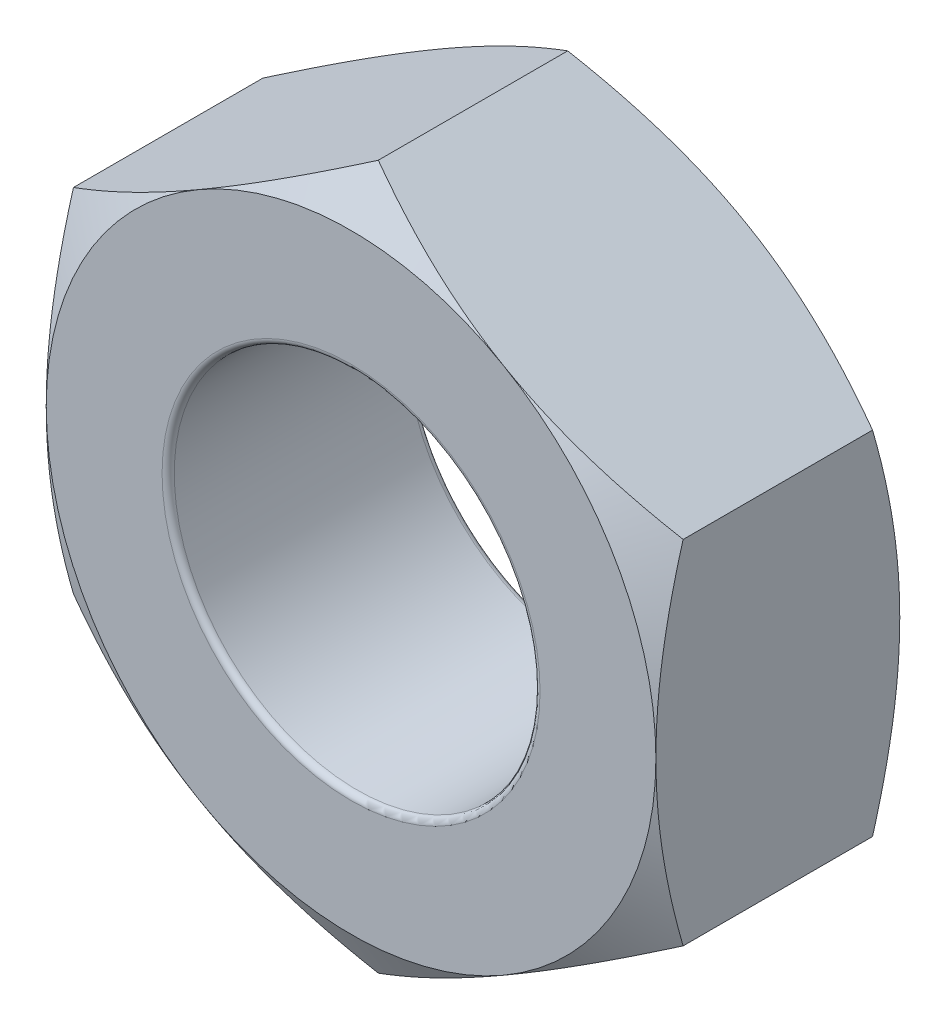
ISO-10303-21;
HEADER;
FILE_DESCRIPTION(('STEP AP214'),'2;1');
FILE_NAME('part.step','',(''),(''),'','','');
FILE_SCHEMA(('AUTOMOTIVE_DESIGN { 1 0 10303 214 1 1 1 1 }'));
ENDSEC;
DATA;
#1=APPLICATION_CONTEXT('core data for automotive mechanical design processes');
#2=APPLICATION_PROTOCOL_DEFINITION('international standard','automotive_design',2000,#1);
#3=PRODUCT_CONTEXT('',#1,'mechanical');
#4=PRODUCT('Part','Part','',(#3));
#5=PRODUCT_RELATED_PRODUCT_CATEGORY('part','',(#4));
#6=PRODUCT_DEFINITION_FORMATION('','',#4);
#7=PRODUCT_DEFINITION_CONTEXT('part definition',#1,'design');
#8=PRODUCT_DEFINITION('design','',#6,#7);
#9=PRODUCT_DEFINITION_SHAPE('','',#8);
#10=(LENGTH_UNIT() NAMED_UNIT(*) SI_UNIT(.MILLI.,.METRE.));
#11=(NAMED_UNIT(*) PLANE_ANGLE_UNIT() SI_UNIT($,.RADIAN.));
#12=(NAMED_UNIT(*) SI_UNIT($,.STERADIAN.) SOLID_ANGLE_UNIT());
#13=UNCERTAINTY_MEASURE_WITH_UNIT(LENGTH_MEASURE(1.E-05),#10,'distance_accuracy_value','');
#14=(GEOMETRIC_REPRESENTATION_CONTEXT(3) GLOBAL_UNCERTAINTY_ASSIGNED_CONTEXT((#13)) GLOBAL_UNIT_ASSIGNED_CONTEXT((#10,
#11,#12)) REPRESENTATION_CONTEXT('',''));
#15=CARTESIAN_POINT('',(0.,0.,0.));
#16=DIRECTION('',(0.,0.,1.));
#17=DIRECTION('',(1.,0.,0.));
#18=AXIS2_PLACEMENT_3D('',#15,#16,#17);
#19=CARTESIAN_POINT('',(-2.5,-1.44337567297407,2.));
#20=DIRECTION('',(0.5,0.866025403784439,0.));
#21=DIRECTION('',(-0.866025403784439,0.5,0.));
#22=AXIS2_PLACEMENT_3D('',#19,#20,#21);
#23=PLANE('',#22);
#24=CARTESIAN_POINT('',(0.000199999999999842,-2.88686681600197,0.223357664359108));
#25=CARTESIAN_POINT('',(-0.109663234734871,-2.82343724785375,0.186721620107626));
#26=CARTESIAN_POINT('',(-0.220474799896526,-2.75946016087834,0.153402218965056));
#27=CARTESIAN_POINT('',(-0.44401683346605,-2.63039810762178,0.0952422855578576));
#28=CARTESIAN_POINT('',(-0.556751274528388,-2.5653108477275,0.0704223291477381));
#29=CARTESIAN_POINT('',(-0.780822993875269,-2.43594298024479,0.0317856514410519));
#30=CARTESIAN_POINT('',(-0.892125791767377,-2.37168227992023,0.0177117961856389));
#31=CARTESIAN_POINT('',(-1.11525522746833,-2.24285844015415,0.000909152352750234));
#32=CARTESIAN_POINT('',(-1.22708105401423,-2.17829576909553,-0.00183354879637336));
#33=CARTESIAN_POINT('',(-1.43604197555152,-2.05765212479586,0.00386576000805364));
#34=CARTESIAN_POINT('',(-1.53320831755773,-2.0015531110824,0.0109083943818618));
#35=CARTESIAN_POINT('',(-1.726907949711,-1.88972057631678,0.0332314191249426));
#36=CARTESIAN_POINT('',(-1.82344056965973,-1.8339874422038,0.0485194384402671));
#37=CARTESIAN_POINT('',(-2.01753972174048,-1.7219242445005,0.0867390938444203));
#38=CARTESIAN_POINT('',(-2.11508168178214,-1.66560836761316,0.109832776125517));
#39=CARTESIAN_POINT('',(-2.30871060807609,-1.55381665489446,0.162246656577913));
#40=CARTESIAN_POINT('',(-2.40480005588618,-1.49833938633502,0.191554535624548));
#41=CARTESIAN_POINT('',(-2.5002,-1.44326020292023,0.223357664359108));
#42=B_SPLINE_CURVE_WITH_KNOTS('',3,(#24,#25,#26,#27,#28,#29,#30,#31,#32,#33,#34,#35,#36,#37,#38,
#39,#40,#41),.UNSPECIFIED.,.F.,.F.,(4,2,2,2,2,2,2,2,4),(0.,0.396285827362227,0.793524330152051,
1.18093086852114,1.56786160134475,1.90479741793733,2.24204551660463,2.58677531536756,
2.93082800105256),.UNSPECIFIED.);
#43=CARTESIAN_POINT('',(0.,-2.88675134594813,0.223290993692601));
#44=VERTEX_POINT('',#43);
#45=CARTESIAN_POINT('',(-1.25,-2.1650635094611,0.));
#46=VERTEX_POINT('',#45);
#47=EDGE_CURVE('E374',#44,#46,#42,.T.);
#48=ORIENTED_EDGE('',*,*,#47,.F.);
#49=DIRECTION('',(0.,0.,-1.));
#50=VECTOR('',#49,1.);
#51=CARTESIAN_POINT('',(0.,-2.88675134594813,2.));
#52=LINE('',#51,#50);
#53=CARTESIAN_POINT('',(0.,-2.88675134594813,1.7767090063074));
#54=VERTEX_POINT('',#53);
#55=EDGE_CURVE('E318',#54,#44,#52,.T.);
#56=ORIENTED_EDGE('',*,*,#55,.F.);
#57=CARTESIAN_POINT('',(-2.5002,-1.44326020292023,1.77664233564089));
#58=CARTESIAN_POINT('',(-2.39033676526513,-1.50668977106845,1.81327837989237));
#59=CARTESIAN_POINT('',(-2.27952520010348,-1.57066685804385,1.84659778103494));
#60=CARTESIAN_POINT('',(-2.05598316653395,-1.69972891130041,1.90475771444214));
#61=CARTESIAN_POINT('',(-1.94324872547161,-1.7648161711947,1.92957767085226));
#62=CARTESIAN_POINT('',(-1.71917700612473,-1.8941840386774,1.96821434855895));
#63=CARTESIAN_POINT('',(-1.60787420823262,-1.95844473900197,1.98228820381436));
#64=CARTESIAN_POINT('',(-1.38474477253167,-2.08726857876804,1.99909084764725));
#65=CARTESIAN_POINT('',(-1.27291894598577,-2.15183124982667,2.00183354879637));
#66=CARTESIAN_POINT('',(-1.06395802444848,-2.27247489412634,1.99613423999195));
#67=CARTESIAN_POINT('',(-0.966791682442269,-2.32857390783979,1.98909160561814));
#68=CARTESIAN_POINT('',(-0.773092050288998,-2.44040644260542,1.96676858087506));
#69=CARTESIAN_POINT('',(-0.676559430340268,-2.4961395767184,1.95148056155973));
#70=CARTESIAN_POINT('',(-0.482460278259524,-2.60820277442169,1.91326090615558));
#71=CARTESIAN_POINT('',(-0.38491831821786,-2.66451865130903,1.89016722387448));
#72=CARTESIAN_POINT('',(-0.191289391923915,-2.77631036402774,1.83775334342209));
#73=CARTESIAN_POINT('',(-0.095199944113824,-2.83178763258718,1.80844546437545));
#74=CARTESIAN_POINT('',(0.000199999999999875,-2.88686681600197,1.77664233564089));
#75=B_SPLINE_CURVE_WITH_KNOTS('',3,(#57,#58,#59,#60,#61,#62,#63,#64,#65,#66,#67,#68,#69,#70,#71,
#72,#73,#74),.UNSPECIFIED.,.F.,.F.,(4,2,2,2,2,2,2,2,4),(0.,0.396285827362227,0.793524330152051,
1.18093086852114,1.56786160134475,1.90479741793733,2.24204551660463,2.58677531536756,
2.93082800105256),.UNSPECIFIED.);
#76=CARTESIAN_POINT('',(-1.25,-2.1650635094611,2.));
#77=VERTEX_POINT('',#76);
#78=EDGE_CURVE('E257',#77,#54,#75,.T.);
#79=ORIENTED_EDGE('',*,*,#78,.F.);
#80=CARTESIAN_POINT('',(-2.5,-1.44337567297407,1.7767090063074));
#81=VERTEX_POINT('',#80);
#82=EDGE_CURVE('E331',#81,#77,#75,.T.);
#83=ORIENTED_EDGE('',*,*,#82,.F.);
#84=DIRECTION('',(0.,0.,-1.));
#85=VECTOR('',#84,1.);
#86=CARTESIAN_POINT('',(-2.5,-1.44337567297407,2.));
#87=LINE('',#86,#85);
#88=CARTESIAN_POINT('',(-2.5,-1.44337567297407,0.223290993692602));
#89=VERTEX_POINT('',#88);
#90=EDGE_CURVE('E329',#81,#89,#87,.T.);
#91=ORIENTED_EDGE('',*,*,#90,.T.);
#92=EDGE_CURVE('E211',#46,#89,#42,.T.);
#93=ORIENTED_EDGE('',*,*,#92,.F.);
#94=EDGE_LOOP('',(#48,#56,#79,#83,#91,#93));
#95=FACE_BOUND('',#94,.T.);
#96=ADVANCED_FACE('F37',(#95),#23,.F.);
#97=CARTESIAN_POINT('',(0.,-2.88675134594813,2.));
#98=DIRECTION('',(-0.5,0.866025403784439,0.));
#99=DIRECTION('',(-0.866025403784439,-0.5,0.));
#100=AXIS2_PLACEMENT_3D('',#97,#98,#99);
#101=PLANE('',#100);
#102=CARTESIAN_POINT('',(2.5002,-1.44326020292023,0.223357664359109));
#103=CARTESIAN_POINT('',(2.39033676526513,-1.50668977106845,0.186721620107626));
#104=CARTESIAN_POINT('',(2.27952520010348,-1.57066685804385,0.153402218965056));
#105=CARTESIAN_POINT('',(2.05598316653395,-1.69972891130041,0.0952422855578581));
#106=CARTESIAN_POINT('',(1.94324872547161,-1.7648161711947,0.0704223291477387));
#107=CARTESIAN_POINT('',(1.71917700612473,-1.8941840386774,0.0317856514410525));
#108=CARTESIAN_POINT('',(1.60787420823262,-1.95844473900197,0.0177117961856395));
#109=CARTESIAN_POINT('',(1.38474477253167,-2.08726857876804,0.000909152352750747));
#110=CARTESIAN_POINT('',(1.27291894598577,-2.15183124982667,-0.00183354879637297));
#111=CARTESIAN_POINT('',(1.06395802444848,-2.27247489412634,0.00386576000805378));
#112=CARTESIAN_POINT('',(0.96679168244227,-2.32857390783979,0.0109083943818619));
#113=CARTESIAN_POINT('',(0.773092050288998,-2.44040644260542,0.0332314191249426));
#114=CARTESIAN_POINT('',(0.676559430340268,-2.4961395767184,0.0485194384402671));
#115=CARTESIAN_POINT('',(0.482460278259524,-2.60820277442169,0.0867390938444202));
#116=CARTESIAN_POINT('',(0.38491831821786,-2.66451865130903,0.109832776125517));
#117=CARTESIAN_POINT('',(0.191289391923915,-2.77631036402774,0.162246656577913));
#118=CARTESIAN_POINT('',(0.0951999441138241,-2.83178763258718,0.191554535624548));
#119=CARTESIAN_POINT('',(-0.000199999999999849,-2.88686681600197,0.223357664359108));
#120=B_SPLINE_CURVE_WITH_KNOTS('',3,(#102,#103,#104,#105,#106,#107,#108,#109,#110,#111,#112,
#113,#114,#115,#116,#117,#118,#119),.UNSPECIFIED.,.F.,.F.,(4,2,2,2,2,2,2,2,4),(0.,
0.396285827362227,0.793524330152051,1.18093086852114,1.56786160134475,1.90479741793733,
2.24204551660463,2.58677531536756,2.93082800105256),.UNSPECIFIED.);
#121=CARTESIAN_POINT('',(2.5,-1.44337567297406,0.223290993692602));
#122=VERTEX_POINT('',#121);
#123=CARTESIAN_POINT('',(1.25,-2.1650635094611,0.));
#124=VERTEX_POINT('',#123);
#125=EDGE_CURVE('E147',#122,#124,#120,.T.);
#126=ORIENTED_EDGE('',*,*,#125,.F.);
#127=DIRECTION('',(0.,0.,-1.));
#128=VECTOR('',#127,1.);
#129=CARTESIAN_POINT('',(2.5,-1.44337567297406,2.));
#130=LINE('',#129,#128);
#131=CARTESIAN_POINT('',(2.5,-1.44337567297406,1.7767090063074));
#132=VERTEX_POINT('',#131);
#133=EDGE_CURVE('E162',#132,#122,#130,.T.);
#134=ORIENTED_EDGE('',*,*,#133,.F.);
#135=CARTESIAN_POINT('',(-0.000200000000000107,-2.88686681600197,1.77664233564089));
#136=CARTESIAN_POINT('',(0.109663234734871,-2.82343724785375,1.81327837989237));
#137=CARTESIAN_POINT('',(0.220474799896526,-2.75946016087834,1.84659778103494));
#138=CARTESIAN_POINT('',(0.44401683346605,-2.63039810762178,1.90475771444214));
#139=CARTESIAN_POINT('',(0.556751274528388,-2.5653108477275,1.92957767085226));
#140=CARTESIAN_POINT('',(0.780822993875269,-2.43594298024479,1.96821434855895));
#141=CARTESIAN_POINT('',(0.892125791767377,-2.37168227992023,1.98228820381436));
#142=CARTESIAN_POINT('',(1.11525522746833,-2.24285844015415,1.99909084764725));
#143=CARTESIAN_POINT('',(1.22708105401423,-2.17829576909553,2.00183354879637));
#144=CARTESIAN_POINT('',(1.43604197555152,-2.05765212479586,1.99613423999195));
#145=CARTESIAN_POINT('',(1.53320831755773,-2.0015531110824,1.98909160561814));
#146=CARTESIAN_POINT('',(1.726907949711,-1.88972057631678,1.96676858087506));
#147=CARTESIAN_POINT('',(1.82344056965973,-1.8339874422038,1.95148056155973));
#148=CARTESIAN_POINT('',(2.01753972174048,-1.7219242445005,1.91326090615558));
#149=CARTESIAN_POINT('',(2.11508168178214,-1.66560836761316,1.89016722387448));
#150=CARTESIAN_POINT('',(2.30871060807609,-1.55381665489446,1.83775334342209));
#151=CARTESIAN_POINT('',(2.40480005588618,-1.49833938633502,1.80844546437545));
#152=CARTESIAN_POINT('',(2.5002,-1.44326020292023,1.77664233564089));
#153=B_SPLINE_CURVE_WITH_KNOTS('',3,(#135,#136,#137,#138,#139,#140,#141,#142,#143,#144,#145,
#146,#147,#148,#149,#150,#151,#152),.UNSPECIFIED.,.F.,.F.,(4,2,2,2,2,2,2,2,4),(0.,
0.396285827362227,0.793524330152051,1.18093086852114,1.56786160134475,1.90479741793733,
2.24204551660463,2.58677531536756,2.93082800105257),.UNSPECIFIED.);
#154=CARTESIAN_POINT('',(1.25,-2.1650635094611,2.));
#155=VERTEX_POINT('',#154);
#156=EDGE_CURVE('E250',#155,#132,#153,.T.);
#157=ORIENTED_EDGE('',*,*,#156,.F.);
#158=EDGE_CURVE('E256',#54,#155,#153,.T.);
#159=ORIENTED_EDGE('',*,*,#158,.F.);
#160=ORIENTED_EDGE('',*,*,#55,.T.);
#161=EDGE_CURVE('E172',#124,#44,#120,.T.);
#162=ORIENTED_EDGE('',*,*,#161,.F.);
#163=EDGE_LOOP('',(#126,#134,#157,#159,#160,#162));
#164=FACE_BOUND('',#163,.T.);
#165=ADVANCED_FACE('F263',(#164),#101,.F.);
#166=CARTESIAN_POINT('',(2.5,-1.44337567297406,2.));
#167=DIRECTION('',(-1.,0.,0.));
#168=DIRECTION('',(0.,-1.,0.));
#169=AXIS2_PLACEMENT_3D('',#166,#167,#168);
#170=PLANE('',#169);
#171=CARTESIAN_POINT('',(2.5,4.93486171933444,1.75051746805577));
#172=CARTESIAN_POINT('',(2.5,4.8199403481942,1.69133726261722));
#173=CARTESIAN_POINT('',(2.5,4.70485212642124,1.63247825676005));
#174=CARTESIAN_POINT('',(2.5,4.47426567976795,1.51556406119456));
#175=CARTESIAN_POINT('',(2.5,4.3587674473533,1.45750888635444));
#176=CARTESIAN_POINT('',(2.5,4.12710089531368,1.34227244134488));
#177=CARTESIAN_POINT('',(2.5,4.01093179192169,1.28509274407798));
#178=CARTESIAN_POINT('',(2.5,3.77801122649482,1.17192590701674));
#179=CARTESIAN_POINT('',(2.5,3.66125975622101,1.11593878415348));
#180=CARTESIAN_POINT('',(2.5,3.42088300849687,1.00253157682963));
#181=CARTESIAN_POINT('',(2.5,3.2972198482005,0.94519156160896));
#182=CARTESIAN_POINT('',(2.5,3.04894788037271,0.832598686179217));
#183=CARTESIAN_POINT('',(2.5,2.92433909834247,0.777345769924557));
#184=CARTESIAN_POINT('',(2.5,2.67404231382757,0.669564709168185));
#185=CARTESIAN_POINT('',(2.5,2.54835509963059,0.617034744165752));
#186=CARTESIAN_POINT('',(2.5,2.29553518807958,0.51547060395183));
#187=CARTESIAN_POINT('',(2.5,2.16840216282304,0.466437240853759));
#188=CARTESIAN_POINT('',(2.5,1.89196933857389,0.365519045589161));
#189=CARTESIAN_POINT('',(2.5,1.74237414052598,0.314430928565566));
#190=CARTESIAN_POINT('',(2.5,1.4405551511059,0.220856049236355));
#191=CARTESIAN_POINT('',(2.5,1.28833272889575,0.178364945289854));
#192=CARTESIAN_POINT('',(2.5,0.983942199808397,0.10575228958798));
#193=CARTESIAN_POINT('',(2.5,0.831829132495783,0.0754089672818123));
#194=CARTESIAN_POINT('',(2.5,0.602071425625843,0.0406516796303225));
#195=CARTESIAN_POINT('',(2.5,0.525228449493817,0.0308592992319918));
#196=CARTESIAN_POINT('',(2.5,0.371150643177173,0.015163665679469));
#197=CARTESIAN_POINT('',(2.5,0.293915874561849,0.00925981943211573));
#198=CARTESIAN_POINT('',(2.5,0.13817730801555,0.00149945618362761));
#199=CARTESIAN_POINT('',(2.5,0.0596706558577326,-0.000300329680071862));
#200=CARTESIAN_POINT('',(2.5,-0.0973237037747566,0.000382182470509603));
#201=CARTESIAN_POINT('',(2.5,-0.175811411250472,0.00286448024899066));
#202=CARTESIAN_POINT('',(2.5,-0.33255646239666,0.0120180751018753));
#203=CARTESIAN_POINT('',(2.5,-0.410813755021101,0.0186902391546229));
#204=CARTESIAN_POINT('',(2.5,-0.566895759516456,0.0359818737124392));
#205=CARTESIAN_POINT('',(2.5,-0.644720398746937,0.0466019878865543));
#206=CARTESIAN_POINT('',(2.5,-0.880425277323258,0.0843776540425927));
#207=CARTESIAN_POINT('',(2.5,-1.0374021276822,0.11724429044599));
#208=CARTESIAN_POINT('',(2.5,-1.34841101742391,0.194551132550417));
#209=CARTESIAN_POINT('',(2.5,-1.50244211517955,0.23899497472662));
#210=CARTESIAN_POINT('',(2.5,-1.80198948227857,0.334467726657708));
#211=CARTESIAN_POINT('',(2.5,-1.94760725909514,0.385183371784437));
#212=CARTESIAN_POINT('',(2.5,-2.23674360042291,0.492317846941426));
#213=CARTESIAN_POINT('',(2.5,-2.38026164031034,0.548738075330582));
#214=CARTESIAN_POINT('',(2.5,-2.66572180096044,0.665809108984892));
#215=CARTESIAN_POINT('',(2.5,-2.80766213451906,0.726464237701915));
#216=CARTESIAN_POINT('',(2.5,-3.0901760741915,0.850881769521233));
#217=CARTESIAN_POINT('',(2.5,-3.23074960496675,0.914644342755144));
#218=CARTESIAN_POINT('',(2.5,-3.50283338488746,1.04081855009125));
#219=CARTESIAN_POINT('',(2.5,-3.63440403331771,1.10310046173394));
#220=CARTESIAN_POINT('',(2.5,-3.89676431270017,1.2292955254876));
#221=CARTESIAN_POINT('',(2.5,-4.02755391777178,1.29320873128699));
#222=CARTESIAN_POINT('',(2.5,-4.28806433847912,1.42210820195559));
#223=CARTESIAN_POINT('',(2.5,-4.41778725733017,1.48709022600769));
#224=CARTESIAN_POINT('',(2.5,-4.67669676330922,1.61808743263322));
#225=CARTESIAN_POINT('',(2.5,-4.8058833956229,1.68410252583257));
#226=CARTESIAN_POINT('',(2.5,-4.93486171933444,1.75051746805577));
#227=B_SPLINE_CURVE_WITH_KNOTS('',3,(#171,#172,#173,#174,#175,#176,#177,#178,#179,#180,#181,
#182,#183,#184,#185,#186,#187,#188,#189,#190,#191,#192,#193,#194,#195,#196,#197,#198,#199,#200,
#201,#202,#203,#204,#205,#206,#207,#208,#209,#210,#211,#212,#213,#214,#215,#216,#217,#218,#219,
#220,#221,#222,#223,#224,#225,#226),.UNSPECIFIED.,.F.,.F.,(4,2,2,2,2,2,2,2,2,2,2,2,2,2,2,2,2,2,
2,2,2,2,2,2,2,2,2,4),(0.,0.387793831894924,0.775594827128252,1.16402581850153,1.5524623207934,
1.96137758264064,2.37028185592793,2.77890912291194,3.1876309897647,3.66167496284643,
4.13547893462243,4.60018855861607,4.83249783003166,5.06477166059454,5.30023727903514,
5.53570288450944,5.77121722921933,6.00676998875775,6.48725754661897,6.96789621109928,
7.43032586595214,7.89286915182353,8.35589175957823,8.81893974621792,9.25562834373433,
9.69233133192936,10.1275921173417,10.5628154528867),.UNSPECIFIED.);
#228=CARTESIAN_POINT('',(2.5,1.44337567297407,0.223290993692602));
#229=VERTEX_POINT('',#228);
#230=CARTESIAN_POINT('',(2.5,0.,0.));
#231=VERTEX_POINT('',#230);
#232=EDGE_CURVE('E126',#229,#231,#227,.T.);
#233=ORIENTED_EDGE('',*,*,#232,.F.);
#234=DIRECTION('',(0.,0.,-1.));
#235=VECTOR('',#234,1.);
#236=CARTESIAN_POINT('',(2.5,1.44337567297407,2.));
#237=LINE('',#236,#235);
#238=CARTESIAN_POINT('',(2.5,1.44337567297407,1.7767090063074));
#239=VERTEX_POINT('',#238);
#240=EDGE_CURVE('E322',#239,#229,#237,.T.);
#241=ORIENTED_EDGE('',*,*,#240,.F.);
#242=CARTESIAN_POINT('',(2.5,-4.93486171933444,0.249482531944228));
#243=CARTESIAN_POINT('',(2.5,-4.8199403481942,0.308662737382781));
#244=CARTESIAN_POINT('',(2.5,-4.70485212642124,0.36752174323995));
#245=CARTESIAN_POINT('',(2.5,-4.47426567976795,0.48443593880544));
#246=CARTESIAN_POINT('',(2.5,-4.3587674473533,0.542491113645563));
#247=CARTESIAN_POINT('',(2.5,-4.12710089531368,0.657727558655123));
#248=CARTESIAN_POINT('',(2.5,-4.01093179192169,0.714907255922022));
#249=CARTESIAN_POINT('',(2.5,-3.77801122649482,0.828074092983264));
#250=CARTESIAN_POINT('',(2.5,-3.66125975622101,0.884061215846521));
#251=CARTESIAN_POINT('',(2.5,-3.42088300849687,0.997468423170368));
#252=CARTESIAN_POINT('',(2.5,-3.2972198482005,1.05480843839104));
#253=CARTESIAN_POINT('',(2.5,-3.04894788037271,1.16740131382078));
#254=CARTESIAN_POINT('',(2.5,-2.92433909834247,1.22265423007544));
#255=CARTESIAN_POINT('',(2.5,-2.67404231382757,1.33043529083182));
#256=CARTESIAN_POINT('',(2.5,-2.54835509963059,1.38296525583425));
#257=CARTESIAN_POINT('',(2.5,-2.29553518807957,1.48452939604817));
#258=CARTESIAN_POINT('',(2.5,-2.16840216282304,1.53356275914624));
#259=CARTESIAN_POINT('',(2.5,-1.89196933857388,1.63448095441084));
#260=CARTESIAN_POINT('',(2.5,-1.74237414052597,1.68556907143443));
#261=CARTESIAN_POINT('',(2.5,-1.4405551511059,1.77914395076365));
#262=CARTESIAN_POINT('',(2.5,-1.28833272889575,1.82163505471015));
#263=CARTESIAN_POINT('',(2.5,-0.983942199808395,1.89424771041202));
#264=CARTESIAN_POINT('',(2.5,-0.831829132495782,1.92459103271819));
#265=CARTESIAN_POINT('',(2.5,-0.602071425625842,1.95934832036968));
#266=CARTESIAN_POINT('',(2.5,-0.525228449493816,1.96914070076801));
#267=CARTESIAN_POINT('',(2.5,-0.371150643177171,1.98483633432053));
#268=CARTESIAN_POINT('',(2.5,-0.293915874561847,1.99074018056788));
#269=CARTESIAN_POINT('',(2.5,-0.138177308015548,1.99850054381637));
#270=CARTESIAN_POINT('',(2.5,-0.0596706558577308,2.00030032968007));
#271=CARTESIAN_POINT('',(2.5,0.0973237037747584,1.99961781752949));
#272=CARTESIAN_POINT('',(2.5,0.175811411250474,1.99713551975101));
#273=CARTESIAN_POINT('',(2.5,0.332556462396662,1.98798192489812));
#274=CARTESIAN_POINT('',(2.5,0.410813755021103,1.98130976084538));
#275=CARTESIAN_POINT('',(2.5,0.566895759516458,1.96401812628756));
#276=CARTESIAN_POINT('',(2.5,0.644720398746939,1.95339801211345));
#277=CARTESIAN_POINT('',(2.5,0.88042527732326,1.91562234595741));
#278=CARTESIAN_POINT('',(2.5,1.0374021276822,1.88275570955401));
#279=CARTESIAN_POINT('',(2.5,1.34841101742391,1.80544886744958));
#280=CARTESIAN_POINT('',(2.5,1.50244211517955,1.76100502527338));
#281=CARTESIAN_POINT('',(2.5,1.80198948227857,1.66553227334229));
#282=CARTESIAN_POINT('',(2.5,1.94760725909515,1.61481662821556));
#283=CARTESIAN_POINT('',(2.5,2.23674360042291,1.50768215305857));
#284=CARTESIAN_POINT('',(2.5,2.38026164031034,1.45126192466942));
#285=CARTESIAN_POINT('',(2.5,2.66572180096044,1.33419089101511));
#286=CARTESIAN_POINT('',(2.5,2.80766213451906,1.27353576229808));
#287=CARTESIAN_POINT('',(2.5,3.0901760741915,1.14911823047877));
#288=CARTESIAN_POINT('',(2.5,3.23074960496675,1.08535565724486));
#289=CARTESIAN_POINT('',(2.5,3.50283338488747,0.959181449908747));
#290=CARTESIAN_POINT('',(2.5,3.63440403331771,0.896899538266062));
#291=CARTESIAN_POINT('',(2.5,3.89676431270018,0.770704474512404));
#292=CARTESIAN_POINT('',(2.5,4.02755391777179,0.706791268713009));
#293=CARTESIAN_POINT('',(2.5,4.28806433847913,0.577891798044409));
#294=CARTESIAN_POINT('',(2.5,4.41778725733018,0.512909773992308));
#295=CARTESIAN_POINT('',(2.5,4.67669676330922,0.381912567366776));
#296=CARTESIAN_POINT('',(2.5,4.8058833956229,0.315897474167429));
#297=CARTESIAN_POINT('',(2.5,4.93486171933444,0.249482531944229));
#298=B_SPLINE_CURVE_WITH_KNOTS('',3,(#242,#243,#244,#245,#246,#247,#248,#249,#250,#251,#252,
#253,#254,#255,#256,#257,#258,#259,#260,#261,#262,#263,#264,#265,#266,#267,#268,#269,#270,#271,
#272,#273,#274,#275,#276,#277,#278,#279,#280,#281,#282,#283,#284,#285,#286,#287,#288,#289,#290,
#291,#292,#293,#294,#295,#296,#297),.UNSPECIFIED.,.F.,.F.,(4,2,2,2,2,2,2,2,2,2,2,2,2,2,2,2,2,2,
2,2,2,2,2,2,2,2,2,4),(0.,0.387793831894923,0.775594827128251,1.16402581850153,1.5524623207934,
1.96137758264064,2.37028185592793,2.77890912291195,3.1876309897647,3.66167496284643,
4.13547893462243,4.60018855861608,4.83249783003166,5.06477166059454,5.30023727903514,
5.53570288450944,5.77121722921933,6.00676998875775,6.48725754661897,6.96789621109928,
7.43032586595214,7.89286915182353,8.35589175957823,8.81893974621792,9.25562834373433,
9.69233133192937,10.1275921173417,10.5628154528867),.UNSPECIFIED.);
#299=CARTESIAN_POINT('',(2.5,0.,2.));
#300=VERTEX_POINT('',#299);
#301=EDGE_CURVE('E243',#300,#239,#298,.T.);
#302=ORIENTED_EDGE('',*,*,#301,.F.);
#303=EDGE_CURVE('E249',#132,#300,#298,.T.);
#304=ORIENTED_EDGE('',*,*,#303,.F.);
#305=ORIENTED_EDGE('',*,*,#133,.T.);
#306=EDGE_CURVE('E139',#231,#122,#227,.T.);
#307=ORIENTED_EDGE('',*,*,#306,.F.);
#308=EDGE_LOOP('',(#233,#241,#302,#304,#305,#307));
#309=FACE_BOUND('',#308,.T.);
#310=ADVANCED_FACE('F159',(#309),#170,.F.);
#311=CARTESIAN_POINT('',(2.5,1.44337567297407,2.));
#312=DIRECTION('',(-0.5,-0.866025403784439,0.));
#313=DIRECTION('',(0.866025403784439,-0.5,0.));
#314=AXIS2_PLACEMENT_3D('',#311,#312,#313);
#315=PLANE('',#314);
#316=CARTESIAN_POINT('',(-0.000200000000001077,2.88686681600197,0.223357664359108));
#317=CARTESIAN_POINT('',(0.10966323473487,2.82343724785375,0.186721620107626));
#318=CARTESIAN_POINT('',(0.220474799896525,2.75946016087834,0.153402218965056));
#319=CARTESIAN_POINT('',(0.444016833466049,2.63039810762178,0.0952422855578579));
#320=CARTESIAN_POINT('',(0.556751274528387,2.5653108477275,0.0704223291477386));
#321=CARTESIAN_POINT('',(0.780822993875268,2.43594298024479,0.0317856514410523));
#322=CARTESIAN_POINT('',(0.892125791767376,2.37168227992023,0.0177117961856391));
#323=CARTESIAN_POINT('',(1.11525522746833,2.24285844015415,0.000909152352750306));
#324=CARTESIAN_POINT('',(1.22708105401423,2.17829576909553,-0.00183354879637321));
#325=CARTESIAN_POINT('',(1.43604197555152,2.05765212479586,0.00386576000805375));
#326=CARTESIAN_POINT('',(1.53320831755773,2.0015531110824,0.0109083943818619));
#327=CARTESIAN_POINT('',(1.726907949711,1.88972057631678,0.0332314191249426));
#328=CARTESIAN_POINT('',(1.82344056965973,1.8339874422038,0.0485194384402671));
#329=CARTESIAN_POINT('',(2.01753972174048,1.7219242445005,0.0867390938444204));
#330=CARTESIAN_POINT('',(2.11508168178214,1.66560836761316,0.109832776125517));
#331=CARTESIAN_POINT('',(2.30871060807609,1.55381665489446,0.162246656577913));
#332=CARTESIAN_POINT('',(2.40480005588618,1.49833938633502,0.191554535624549));
#333=CARTESIAN_POINT('',(2.5002,1.44326020292023,0.223357664359108));
#334=B_SPLINE_CURVE_WITH_KNOTS('',3,(#316,#317,#318,#319,#320,#321,#322,#323,#324,#325,#326,
#327,#328,#329,#330,#331,#332,#333),.UNSPECIFIED.,.F.,.F.,(4,2,2,2,2,2,2,2,4),(0.,
0.396285827362227,0.793524330152051,1.18093086852114,1.56786160134475,1.90479741793733,
2.24204551660463,2.58677531536756,2.93082800105257),.UNSPECIFIED.);
#335=CARTESIAN_POINT('',(0.,2.88675134594813,0.223290993692601));
#336=VERTEX_POINT('',#335);
#337=CARTESIAN_POINT('',(1.25,2.1650635094611,0.));
#338=VERTEX_POINT('',#337);
#339=EDGE_CURVE('E52',#336,#338,#334,.T.);
#340=ORIENTED_EDGE('',*,*,#339,.F.);
#341=DIRECTION('',(0.,0.,-1.));
#342=VECTOR('',#341,1.);
#343=CARTESIAN_POINT('',(0.,2.88675134594813,2.));
#344=LINE('',#343,#342);
#345=CARTESIAN_POINT('',(0.,2.88675134594813,1.7767090063074));
#346=VERTEX_POINT('',#345);
#347=EDGE_CURVE('E324',#346,#336,#344,.T.);
#348=ORIENTED_EDGE('',*,*,#347,.F.);
#349=CARTESIAN_POINT('',(2.5002,1.44326020292023,1.77664233564089));
#350=CARTESIAN_POINT('',(2.39033676526513,1.50668977106845,1.81327837989237));
#351=CARTESIAN_POINT('',(2.27952520010348,1.57066685804385,1.84659778103494));
#352=CARTESIAN_POINT('',(2.05598316653395,1.69972891130041,1.90475771444214));
#353=CARTESIAN_POINT('',(1.94324872547161,1.7648161711947,1.92957767085226));
#354=CARTESIAN_POINT('',(1.71917700612473,1.8941840386774,1.96821434855895));
#355=CARTESIAN_POINT('',(1.60787420823262,1.95844473900197,1.98228820381436));
#356=CARTESIAN_POINT('',(1.38474477253167,2.08726857876804,1.99909084764725));
#357=CARTESIAN_POINT('',(1.27291894598577,2.15183124982667,2.00183354879637));
#358=CARTESIAN_POINT('',(1.06395802444848,2.27247489412634,1.99613423999195));
#359=CARTESIAN_POINT('',(0.966791682442269,2.32857390783979,1.98909160561814));
#360=CARTESIAN_POINT('',(0.773092050288997,2.44040644260542,1.96676858087506));
#361=CARTESIAN_POINT('',(0.676559430340267,2.4961395767184,1.95148056155973));
#362=CARTESIAN_POINT('',(0.482460278259523,2.60820277442169,1.91326090615558));
#363=CARTESIAN_POINT('',(0.384918318217859,2.66451865130903,1.89016722387448));
#364=CARTESIAN_POINT('',(0.191289391923914,2.77631036402774,1.83775334342209));
#365=CARTESIAN_POINT('',(0.0951999441138231,2.83178763258718,1.80844546437545));
#366=CARTESIAN_POINT('',(-0.000200000000001067,2.88686681600197,1.77664233564089));
#367=B_SPLINE_CURVE_WITH_KNOTS('',3,(#349,#350,#351,#352,#353,#354,#355,#356,#357,#358,#359,
#360,#361,#362,#363,#364,#365,#366),.UNSPECIFIED.,.F.,.F.,(4,2,2,2,2,2,2,2,4),(0.,
0.396285827362227,0.793524330152051,1.18093086852114,1.56786160134475,1.90479741793733,
2.24204551660463,2.58677531536756,2.93082800105257),.UNSPECIFIED.);
#368=CARTESIAN_POINT('',(1.25,2.1650635094611,2.));
#369=VERTEX_POINT('',#368);
#370=EDGE_CURVE('E230',#369,#346,#367,.T.);
#371=ORIENTED_EDGE('',*,*,#370,.F.);
#372=EDGE_CURVE('E236',#239,#369,#367,.T.);
#373=ORIENTED_EDGE('',*,*,#372,.F.);
#374=ORIENTED_EDGE('',*,*,#240,.T.);
#375=EDGE_CURVE('E133',#338,#229,#334,.T.);
#376=ORIENTED_EDGE('',*,*,#375,.F.);
#377=EDGE_LOOP('',(#340,#348,#371,#373,#374,#376));
#378=FACE_BOUND('',#377,.T.);
#379=ADVANCED_FACE('F222',(#378),#315,.F.);
#380=CARTESIAN_POINT('',(0.,2.88675134594813,2.));
#381=DIRECTION('',(0.5,-0.866025403784439,0.));
#382=DIRECTION('',(0.866025403784439,0.5,0.));
#383=AXIS2_PLACEMENT_3D('',#380,#381,#382);
#384=PLANE('',#383);
#385=CARTESIAN_POINT('',(-2.5002,1.44326020292023,0.223357664359109));
#386=CARTESIAN_POINT('',(-2.39033676526513,1.50668977106845,0.186721620107626));
#387=CARTESIAN_POINT('',(-2.27952520010348,1.57066685804385,0.153402218965056));
#388=CARTESIAN_POINT('',(-2.05598316653395,1.69972891130041,0.0952422855578583));
#389=CARTESIAN_POINT('',(-1.94324872547161,1.7648161711947,0.0704223291477389));
#390=CARTESIAN_POINT('',(-1.71917700612473,1.8941840386774,0.0317856514410526));
#391=CARTESIAN_POINT('',(-1.60787420823262,1.95844473900197,0.0177117961856395));
#392=CARTESIAN_POINT('',(-1.38474477253167,2.08726857876805,0.000909152352750713));
#393=CARTESIAN_POINT('',(-1.27291894598577,2.15183124982667,-0.00183354879637293));
#394=CARTESIAN_POINT('',(-1.06395802444848,2.27247489412634,0.00386576000805397));
#395=CARTESIAN_POINT('',(-0.96679168244227,2.32857390783979,0.0109083943818621));
#396=CARTESIAN_POINT('',(-0.773092050288999,2.44040644260542,0.0332314191249428));
#397=CARTESIAN_POINT('',(-0.676559430340269,2.4961395767184,0.0485194384402673));
#398=CARTESIAN_POINT('',(-0.482460278259525,2.60820277442169,0.0867390938444204));
#399=CARTESIAN_POINT('',(-0.384918318217861,2.66451865130903,0.109832776125517));
#400=CARTESIAN_POINT('',(-0.191289391923916,2.77631036402774,0.162246656577913));
#401=CARTESIAN_POINT('',(-0.0951999441138251,2.83178763258718,0.191554535624548));
#402=CARTESIAN_POINT('',(0.000199999999999186,2.88686681600197,0.223357664359108));
#403=B_SPLINE_CURVE_WITH_KNOTS('',3,(#385,#386,#387,#388,#389,#390,#391,#392,#393,#394,#395,
#396,#397,#398,#399,#400,#401,#402),.UNSPECIFIED.,.F.,.F.,(4,2,2,2,2,2,2,2,4),(0.,
0.396285827362227,0.793524330152051,1.18093086852114,1.56786160134475,1.90479741793733,
2.24204551660463,2.58677531536756,2.93082800105256),.UNSPECIFIED.);
#404=CARTESIAN_POINT('',(-2.5,1.44337567297407,0.223290993692596));
#405=VERTEX_POINT('',#404);
#406=CARTESIAN_POINT('',(-1.25,2.1650635094611,0.));
#407=VERTEX_POINT('',#406);
#408=EDGE_CURVE('E60',#405,#407,#403,.T.);
#409=ORIENTED_EDGE('',*,*,#408,.F.);
#410=DIRECTION('',(0.,0.,-1.));
#411=VECTOR('',#410,1.);
#412=CARTESIAN_POINT('',(-2.5,1.44337567297407,2.));
#413=LINE('',#412,#411);
#414=CARTESIAN_POINT('',(-2.5,1.44337567297407,1.7767090063074));
#415=VERTEX_POINT('',#414);
#416=EDGE_CURVE('E327',#415,#405,#413,.T.);
#417=ORIENTED_EDGE('',*,*,#416,.F.);
#418=CARTESIAN_POINT('',(0.000199999999998983,2.88686681600197,1.77664233564089));
#419=CARTESIAN_POINT('',(-0.109663234734872,2.82343724785375,1.81327837989237));
#420=CARTESIAN_POINT('',(-0.220474799896527,2.75946016087834,1.84659778103494));
#421=CARTESIAN_POINT('',(-0.444016833466051,2.63039810762178,1.90475771444214));
#422=CARTESIAN_POINT('',(-0.556751274528389,2.5653108477275,1.92957767085226));
#423=CARTESIAN_POINT('',(-0.78082299387527,2.43594298024479,1.96821434855895));
#424=CARTESIAN_POINT('',(-0.892125791767378,2.37168227992023,1.98228820381436));
#425=CARTESIAN_POINT('',(-1.11525522746833,2.24285844015415,1.99909084764725));
#426=CARTESIAN_POINT('',(-1.22708105401423,2.17829576909553,2.00183354879637));
#427=CARTESIAN_POINT('',(-1.43604197555152,2.05765212479586,1.99613423999195));
#428=CARTESIAN_POINT('',(-1.53320831755773,2.0015531110824,1.98909160561814));
#429=CARTESIAN_POINT('',(-1.726907949711,1.88972057631678,1.96676858087506));
#430=CARTESIAN_POINT('',(-1.82344056965973,1.8339874422038,1.95148056155973));
#431=CARTESIAN_POINT('',(-2.01753972174048,1.7219242445005,1.91326090615558));
#432=CARTESIAN_POINT('',(-2.11508168178214,1.66560836761316,1.89016722387448));
#433=CARTESIAN_POINT('',(-2.30871060807609,1.55381665489446,1.83775334342209));
#434=CARTESIAN_POINT('',(-2.40480005588618,1.49833938633502,1.80844546437545));
#435=CARTESIAN_POINT('',(-2.5002,1.44326020292023,1.77664233564089));
#436=B_SPLINE_CURVE_WITH_KNOTS('',3,(#418,#419,#420,#421,#422,#423,#424,#425,#426,#427,#428,
#429,#430,#431,#432,#433,#434,#435),.UNSPECIFIED.,.F.,.F.,(4,2,2,2,2,2,2,2,4),(0.,
0.396285827362227,0.793524330152051,1.18093086852114,1.56786160134475,1.90479741793733,
2.24204551660463,2.58677531536756,2.93082800105256),.UNSPECIFIED.);
#437=CARTESIAN_POINT('',(-1.25,2.1650635094611,2.));
#438=VERTEX_POINT('',#437);
#439=EDGE_CURVE('E238',#438,#415,#436,.T.);
#440=ORIENTED_EDGE('',*,*,#439,.F.);
#441=EDGE_CURVE('E237',#346,#438,#436,.T.);
#442=ORIENTED_EDGE('',*,*,#441,.F.);
#443=ORIENTED_EDGE('',*,*,#347,.T.);
#444=EDGE_CURVE('E221',#407,#336,#403,.T.);
#445=ORIENTED_EDGE('',*,*,#444,.F.);
#446=EDGE_LOOP('',(#409,#417,#440,#442,#443,#445));
#447=FACE_BOUND('',#446,.T.);
#448=ADVANCED_FACE('F225',(#447),#384,.F.);
#449=CARTESIAN_POINT('',(-2.5,1.44337567297407,2.));
#450=DIRECTION('',(1.,0.,0.));
#451=DIRECTION('',(0.,1.,0.));
#452=AXIS2_PLACEMENT_3D('',#449,#450,#451);
#453=PLANE('',#452);
#454=CARTESIAN_POINT('',(-2.5,-4.93486171933444,1.75051746805577));
#455=CARTESIAN_POINT('',(-2.5,-4.8199403481942,1.69133726261722));
#456=CARTESIAN_POINT('',(-2.5,-4.70485212642124,1.63247825676005));
#457=CARTESIAN_POINT('',(-2.5,-4.47426567976795,1.51556406119456));
#458=CARTESIAN_POINT('',(-2.5,-4.3587674473533,1.45750888635444));
#459=CARTESIAN_POINT('',(-2.5,-4.12710089531368,1.34227244134488));
#460=CARTESIAN_POINT('',(-2.5,-4.01093179192169,1.28509274407798));
#461=CARTESIAN_POINT('',(-2.5,-3.77801122649482,1.17192590701674));
#462=CARTESIAN_POINT('',(-2.5,-3.66125975622101,1.11593878415348));
#463=CARTESIAN_POINT('',(-2.5,-3.42088300849687,1.00253157682963));
#464=CARTESIAN_POINT('',(-2.5,-3.2972198482005,0.94519156160896));
#465=CARTESIAN_POINT('',(-2.5,-3.04894788037271,0.832598686179217));
#466=CARTESIAN_POINT('',(-2.5,-2.92433909834247,0.777345769924557));
#467=CARTESIAN_POINT('',(-2.5,-2.67404231382757,0.669564709168184));
#468=CARTESIAN_POINT('',(-2.5,-2.54835509963059,0.617034744165752));
#469=CARTESIAN_POINT('',(-2.5,-2.29553518807958,0.515470603951829));
#470=CARTESIAN_POINT('',(-2.5,-2.16840216282304,0.466437240853759));
#471=CARTESIAN_POINT('',(-2.5,-1.89196933857389,0.365519045589161));
#472=CARTESIAN_POINT('',(-2.5,-1.74237414052598,0.314430928565566));
#473=CARTESIAN_POINT('',(-2.5,-1.4405551511059,0.220856049236355));
#474=CARTESIAN_POINT('',(-2.5,-1.28833272889575,0.178364945289854));
#475=CARTESIAN_POINT('',(-2.5,-0.983942199808397,0.10575228958798));
#476=CARTESIAN_POINT('',(-2.5,-0.831829132495783,0.0754089672818123));
#477=CARTESIAN_POINT('',(-2.5,-0.602071425625843,0.0406516796303225));
#478=CARTESIAN_POINT('',(-2.5,-0.525228449493817,0.0308592992319918));
#479=CARTESIAN_POINT('',(-2.5,-0.371150643177173,0.015163665679469));
#480=CARTESIAN_POINT('',(-2.5,-0.293915874561848,0.00925981943211573));
#481=CARTESIAN_POINT('',(-2.5,-0.13817730801555,0.0014994561836276));
#482=CARTESIAN_POINT('',(-2.5,-0.0596706558577325,-0.000300329680071867));
#483=CARTESIAN_POINT('',(-2.5,0.0973237037747567,0.000382182470509608));
#484=CARTESIAN_POINT('',(-2.5,0.175811411250472,0.00286448024899067));
#485=CARTESIAN_POINT('',(-2.5,0.33255646239666,0.0120180751018753));
#486=CARTESIAN_POINT('',(-2.5,0.410813755021101,0.0186902391546229));
#487=CARTESIAN_POINT('',(-2.5,0.566895759516457,0.0359818737124393));
#488=CARTESIAN_POINT('',(-2.5,0.644720398746937,0.0466019878865545));
#489=CARTESIAN_POINT('',(-2.5,0.880425277323259,0.0843776540425931));
#490=CARTESIAN_POINT('',(-2.5,1.0374021276822,0.11724429044599));
#491=CARTESIAN_POINT('',(-2.5,1.34841101742391,0.194551132550417));
#492=CARTESIAN_POINT('',(-2.5,1.50244211517955,0.23899497472662));
#493=CARTESIAN_POINT('',(-2.5,1.80198948227857,0.334467726657708));
#494=CARTESIAN_POINT('',(-2.5,1.94760725909514,0.385183371784437));
#495=CARTESIAN_POINT('',(-2.5,2.23674360042291,0.492317846941426));
#496=CARTESIAN_POINT('',(-2.5,2.38026164031034,0.548738075330582));
#497=CARTESIAN_POINT('',(-2.5,2.66572180096044,0.665809108984892));
#498=CARTESIAN_POINT('',(-2.5,2.80766213451906,0.726464237701915));
#499=CARTESIAN_POINT('',(-2.5,3.0901760741915,0.850881769521233));
#500=CARTESIAN_POINT('',(-2.5,3.23074960496675,0.914644342755145));
#501=CARTESIAN_POINT('',(-2.5,3.50283338488747,1.04081855009125));
#502=CARTESIAN_POINT('',(-2.5,3.63440403331771,1.10310046173394));
#503=CARTESIAN_POINT('',(-2.5,3.89676431270018,1.2292955254876));
#504=CARTESIAN_POINT('',(-2.5,4.02755391777178,1.29320873128699));
#505=CARTESIAN_POINT('',(-2.5,4.28806433847913,1.42210820195559));
#506=CARTESIAN_POINT('',(-2.5,4.41778725733018,1.48709022600769));
#507=CARTESIAN_POINT('',(-2.5,4.67669676330922,1.61808743263322));
#508=CARTESIAN_POINT('',(-2.5,4.8058833956229,1.68410252583257));
#509=CARTESIAN_POINT('',(-2.5,4.93486171933444,1.75051746805577));
#510=B_SPLINE_CURVE_WITH_KNOTS('',3,(#454,#455,#456,#457,#458,#459,#460,#461,#462,#463,#464,
#465,#466,#467,#468,#469,#470,#471,#472,#473,#474,#475,#476,#477,#478,#479,#480,#481,#482,#483,
#484,#485,#486,#487,#488,#489,#490,#491,#492,#493,#494,#495,#496,#497,#498,#499,#500,#501,#502,
#503,#504,#505,#506,#507,#508,#509),.UNSPECIFIED.,.F.,.F.,(4,2,2,2,2,2,2,2,2,2,2,2,2,2,2,2,2,2,
2,2,2,2,2,2,2,2,2,4),(0.,0.387793831894924,0.775594827128252,1.16402581850153,1.5524623207934,
1.96137758264064,2.37028185592793,2.77890912291195,3.1876309897647,3.66167496284643,
4.13547893462243,4.60018855861608,4.83249783003166,5.06477166059454,5.30023727903514,
5.53570288450944,5.77121722921933,6.00676998875775,6.48725754661897,6.96789621109928,
7.43032586595214,7.89286915182353,8.35589175957823,8.81893974621792,9.25562834373433,
9.69233133192937,10.1275921173417,10.5628154528867),.UNSPECIFIED.);
#511=CARTESIAN_POINT('',(-2.5,0.,0.));
#512=VERTEX_POINT('',#511);
#513=EDGE_CURVE('E382',#89,#512,#510,.T.);
#514=ORIENTED_EDGE('',*,*,#513,.F.);
#515=ORIENTED_EDGE('',*,*,#90,.F.);
#516=CARTESIAN_POINT('',(-2.5,4.93486171933444,0.249482531944227));
#517=CARTESIAN_POINT('',(-2.5,4.8199403481942,0.30866273738278));
#518=CARTESIAN_POINT('',(-2.5,4.70485212642124,0.367521743239949));
#519=CARTESIAN_POINT('',(-2.5,4.47426567976795,0.484435938805439));
#520=CARTESIAN_POINT('',(-2.5,4.3587674473533,0.542491113645563));
#521=CARTESIAN_POINT('',(-2.5,4.12710089531368,0.657727558655122));
#522=CARTESIAN_POINT('',(-2.5,4.01093179192169,0.714907255922022));
#523=CARTESIAN_POINT('',(-2.5,3.77801122649482,0.828074092983263));
#524=CARTESIAN_POINT('',(-2.5,3.66125975622101,0.88406121584652));
#525=CARTESIAN_POINT('',(-2.5,3.42088300849687,0.997468423170368));
#526=CARTESIAN_POINT('',(-2.5,3.2972198482005,1.05480843839104));
#527=CARTESIAN_POINT('',(-2.5,3.04894788037271,1.16740131382078));
#528=CARTESIAN_POINT('',(-2.5,2.92433909834247,1.22265423007544));
#529=CARTESIAN_POINT('',(-2.5,2.67404231382757,1.33043529083182));
#530=CARTESIAN_POINT('',(-2.5,2.54835509963059,1.38296525583425));
#531=CARTESIAN_POINT('',(-2.5,2.29553518807957,1.48452939604817));
#532=CARTESIAN_POINT('',(-2.5,2.16840216282304,1.53356275914624));
#533=CARTESIAN_POINT('',(-2.5,1.89196933857389,1.63448095441084));
#534=CARTESIAN_POINT('',(-2.5,1.74237414052598,1.68556907143443));
#535=CARTESIAN_POINT('',(-2.5,1.4405551511059,1.77914395076364));
#536=CARTESIAN_POINT('',(-2.5,1.28833272889575,1.82163505471015));
#537=CARTESIAN_POINT('',(-2.5,0.983942199808396,1.89424771041202));
#538=CARTESIAN_POINT('',(-2.5,0.831829132495782,1.92459103271819));
#539=CARTESIAN_POINT('',(-2.5,0.602071425625843,1.95934832036968));
#540=CARTESIAN_POINT('',(-2.5,0.525228449493817,1.96914070076801));
#541=CARTESIAN_POINT('',(-2.5,0.371150643177172,1.98483633432053));
#542=CARTESIAN_POINT('',(-2.5,0.293915874561848,1.99074018056788));
#543=CARTESIAN_POINT('',(-2.5,0.138177308015549,1.99850054381637));
#544=CARTESIAN_POINT('',(-2.5,0.0596706558577311,2.00030032968007));
#545=CARTESIAN_POINT('',(-2.5,-0.0973237037747584,1.99961781752949));
#546=CARTESIAN_POINT('',(-2.5,-0.175811411250473,1.99713551975101));
#547=CARTESIAN_POINT('',(-2.5,-0.332556462396662,1.98798192489812));
#548=CARTESIAN_POINT('',(-2.5,-0.410813755021102,1.98130976084538));
#549=CARTESIAN_POINT('',(-2.5,-0.566895759516458,1.96401812628756));
#550=CARTESIAN_POINT('',(-2.5,-0.644720398746938,1.95339801211345));
#551=CARTESIAN_POINT('',(-2.5,-0.88042527732326,1.91562234595741));
#552=CARTESIAN_POINT('',(-2.5,-1.0374021276822,1.88275570955401));
#553=CARTESIAN_POINT('',(-2.5,-1.34841101742391,1.80544886744958));
#554=CARTESIAN_POINT('',(-2.5,-1.50244211517955,1.76100502527338));
#555=CARTESIAN_POINT('',(-2.5,-1.80198948227857,1.66553227334229));
#556=CARTESIAN_POINT('',(-2.5,-1.94760725909515,1.61481662821556));
#557=CARTESIAN_POINT('',(-2.5,-2.23674360042291,1.50768215305857));
#558=CARTESIAN_POINT('',(-2.5,-2.38026164031034,1.45126192466942));
#559=CARTESIAN_POINT('',(-2.5,-2.66572180096044,1.33419089101511));
#560=CARTESIAN_POINT('',(-2.5,-2.80766213451906,1.27353576229809));
#561=CARTESIAN_POINT('',(-2.5,-3.0901760741915,1.14911823047877));
#562=CARTESIAN_POINT('',(-2.5,-3.23074960496675,1.08535565724486));
#563=CARTESIAN_POINT('',(-2.5,-3.50283338488747,0.959181449908747));
#564=CARTESIAN_POINT('',(-2.5,-3.63440403331771,0.896899538266062));
#565=CARTESIAN_POINT('',(-2.5,-3.89676431270018,0.770704474512403));
#566=CARTESIAN_POINT('',(-2.5,-4.02755391777179,0.706791268713009));
#567=CARTESIAN_POINT('',(-2.5,-4.28806433847913,0.577891798044409));
#568=CARTESIAN_POINT('',(-2.5,-4.41778725733018,0.512909773992308));
#569=CARTESIAN_POINT('',(-2.5,-4.67669676330922,0.381912567366776));
#570=CARTESIAN_POINT('',(-2.5,-4.8058833956229,0.315897474167429));
#571=CARTESIAN_POINT('',(-2.5,-4.93486171933444,0.249482531944229));
#572=B_SPLINE_CURVE_WITH_KNOTS('',3,(#516,#517,#518,#519,#520,#521,#522,#523,#524,#525,#526,
#527,#528,#529,#530,#531,#532,#533,#534,#535,#536,#537,#538,#539,#540,#541,#542,#543,#544,#545,
#546,#547,#548,#549,#550,#551,#552,#553,#554,#555,#556,#557,#558,#559,#560,#561,#562,#563,#564,
#565,#566,#567,#568,#569,#570,#571),.UNSPECIFIED.,.F.,.F.,(4,2,2,2,2,2,2,2,2,2,2,2,2,2,2,2,2,2,
2,2,2,2,2,2,2,2,2,4),(0.,0.387793831894924,0.775594827128252,1.16402581850153,1.5524623207934,
1.96137758264064,2.37028185592793,2.77890912291195,3.1876309897647,3.66167496284643,
4.13547893462243,4.60018855861608,4.83249783003166,5.06477166059454,5.30023727903514,
5.53570288450945,5.77121722921933,6.00676998875775,6.48725754661897,6.96789621109928,
7.43032586595214,7.89286915182353,8.35589175957823,8.81893974621792,9.25562834373433,
9.69233133192937,10.1275921173417,10.5628154528867),.UNSPECIFIED.);
#573=CARTESIAN_POINT('',(-2.5,0.,2.));
#574=VERTEX_POINT('',#573);
#575=EDGE_CURVE('E312',#574,#81,#572,.T.);
#576=ORIENTED_EDGE('',*,*,#575,.F.);
#577=EDGE_CURVE('E152',#415,#574,#572,.T.);
#578=ORIENTED_EDGE('',*,*,#577,.F.);
#579=ORIENTED_EDGE('',*,*,#416,.T.);
#580=EDGE_CURVE('E196',#512,#405,#510,.T.);
#581=ORIENTED_EDGE('',*,*,#580,.F.);
#582=EDGE_LOOP('',(#514,#515,#576,#578,#579,#581));
#583=FACE_BOUND('',#582,.T.);
#584=ADVANCED_FACE('F307',(#583),#453,.F.);
#585=CARTESIAN_POINT('',(0.,0.,0.));
#586=DIRECTION('',(0.,0.,1.));
#587=DIRECTION('',(1.,0.,0.));
#588=AXIS2_PLACEMENT_3D('',#585,#586,#587);
#589=PLANE('',#588);
#590=CARTESIAN_POINT('',(0.,0.,0.));
#591=DIRECTION('',(0.,0.,1.));
#592=DIRECTION('',(1.,0.,0.));
#593=AXIS2_PLACEMENT_3D('',#590,#591,#592);
#594=CIRCLE('',#593,1.55);
#595=CARTESIAN_POINT('',(1.55,0.,0.));
#596=VERTEX_POINT('',#595);
#597=EDGE_CURVE('E157',#596,#596,#594,.T.);
#598=ORIENTED_EDGE('',*,*,#597,.T.);
#599=EDGE_LOOP('',(#598));
#600=FACE_BOUND('',#599,.T.);
#601=CARTESIAN_POINT('',(0.,0.,0.));
#602=DIRECTION('',(0.,0.,1.));
#603=DIRECTION('',(1.,0.,0.));
#604=AXIS2_PLACEMENT_3D('',#601,#602,#603);
#605=CIRCLE('',#604,2.5);
#606=EDGE_CURVE('E130',#231,#338,#605,.T.);
#607=ORIENTED_EDGE('',*,*,#606,.F.);
#608=EDGE_CURVE('E144',#124,#231,#605,.T.);
#609=ORIENTED_EDGE('',*,*,#608,.F.);
#610=EDGE_CURVE('E151',#46,#124,#605,.T.);
#611=ORIENTED_EDGE('',*,*,#610,.F.);
#612=EDGE_CURVE('E378',#512,#46,#605,.T.);
#613=ORIENTED_EDGE('',*,*,#612,.F.);
#614=CARTESIAN_POINT('',(0.,0.,0.));
#615=DIRECTION('',(0.,0.,-1.));
#616=DIRECTION('',(-1.,0.,0.));
#617=AXIS2_PLACEMENT_3D('',#614,#615,#616);
#618=CIRCLE('',#617,2.5);
#619=EDGE_CURVE('E381',#512,#407,#618,.T.);
#620=ORIENTED_EDGE('',*,*,#619,.T.);
#621=EDGE_CURVE('E156',#338,#407,#605,.T.);
#622=ORIENTED_EDGE('',*,*,#621,.F.);
#623=EDGE_LOOP('',(#607,#609,#611,#613,#620,#622));
#624=FACE_BOUND('',#623,.T.);
#625=ADVANCED_FACE('F154',(#600,#624),#589,.F.);
#626=CARTESIAN_POINT('',(0.,0.,2.));
#627=DIRECTION('',(0.,0.,1.));
#628=DIRECTION('',(1.,0.,0.));
#629=AXIS2_PLACEMENT_3D('',#626,#627,#628);
#630=PLANE('',#629);
#631=CARTESIAN_POINT('',(0.,0.,2.));
#632=DIRECTION('',(0.,0.,1.));
#633=DIRECTION('',(1.,0.,0.));
#634=AXIS2_PLACEMENT_3D('',#631,#632,#633);
#635=CIRCLE('',#634,1.55);
#636=CARTESIAN_POINT('',(1.55,0.,2.));
#637=VERTEX_POINT('',#636);
#638=EDGE_CURVE('E12',#637,#637,#635,.F.);
#639=ORIENTED_EDGE('',*,*,#638,.T.);
#640=EDGE_LOOP('',(#639));
#641=FACE_BOUND('',#640,.T.);
#642=CARTESIAN_POINT('',(0.,0.,2.));
#643=DIRECTION('',(0.,0.,1.));
#644=DIRECTION('',(1.,0.,0.));
#645=AXIS2_PLACEMENT_3D('',#642,#643,#644);
#646=CIRCLE('',#645,2.5);
#647=EDGE_CURVE('E138',#155,#300,#646,.T.);
#648=ORIENTED_EDGE('',*,*,#647,.T.);
#649=EDGE_CURVE('E178',#300,#369,#646,.T.);
#650=ORIENTED_EDGE('',*,*,#649,.T.);
#651=EDGE_CURVE('E354',#369,#438,#646,.T.);
#652=ORIENTED_EDGE('',*,*,#651,.T.);
#653=EDGE_CURVE('E353',#438,#574,#646,.T.);
#654=ORIENTED_EDGE('',*,*,#653,.T.);
#655=EDGE_CURVE('E352',#574,#77,#646,.T.);
#656=ORIENTED_EDGE('',*,*,#655,.T.);
#657=EDGE_CURVE('E343',#77,#155,#646,.T.);
#658=ORIENTED_EDGE('',*,*,#657,.T.);
#659=EDGE_LOOP('',(#648,#650,#652,#654,#656,#658));
#660=FACE_BOUND('',#659,.T.);
#661=ADVANCED_FACE('F293',(#641,#660),#630,.T.);
#662=CARTESIAN_POINT('',(0.,0.,2.));
#663=DIRECTION('',(0.,0.,-1.));
#664=DIRECTION('',(-1.,0.,0.));
#665=AXIS2_PLACEMENT_3D('',#662,#663,#664);
#666=CYLINDRICAL_SURFACE('',#665,1.5);
#667=CARTESIAN_POINT('',(0.,0.,0.0499999999999999));
#668=DIRECTION('',(0.,0.,1.));
#669=DIRECTION('',(1.,0.,0.));
#670=AXIS2_PLACEMENT_3D('',#667,#668,#669);
#671=CIRCLE('',#670,1.5);
#672=CARTESIAN_POINT('',(1.5,0.,0.0499999999999999));
#673=VERTEX_POINT('',#672);
#674=EDGE_CURVE('E45',#673,#673,#671,.F.);
#675=ORIENTED_EDGE('',*,*,#674,.T.);
#676=EDGE_LOOP('',(#675));
#677=FACE_BOUND('',#676,.T.);
#678=CARTESIAN_POINT('',(0.,0.,1.95));
#679=DIRECTION('',(0.,0.,1.));
#680=DIRECTION('',(1.,0.,0.));
#681=AXIS2_PLACEMENT_3D('',#678,#679,#680);
#682=CIRCLE('',#681,1.5);
#683=CARTESIAN_POINT('',(1.5,0.,1.95));
#684=VERTEX_POINT('',#683);
#685=EDGE_CURVE('E284',#684,#684,#682,.T.);
#686=ORIENTED_EDGE('',*,*,#685,.T.);
#687=EDGE_LOOP('',(#686));
#688=FACE_BOUND('',#687,.T.);
#689=ADVANCED_FACE('F290',(#677,#688),#666,.F.);
#690=CARTESIAN_POINT('',(0.,0.,2.));
#691=DIRECTION('',(0.,0.,-1.));
#692=DIRECTION('',(1.,0.,0.));
#693=AXIS2_PLACEMENT_3D('',#690,#691,#692);
#694=CONICAL_SURFACE('',#693,2.5,1.0471975511966);
#695=ORIENTED_EDGE('',*,*,#82,.T.);
#696=ORIENTED_EDGE('',*,*,#655,.F.);
#697=ORIENTED_EDGE('',*,*,#575,.T.);
#698=EDGE_LOOP('',(#695,#696,#697));
#699=FACE_BOUND('',#698,.T.);
#700=ADVANCED_FACE('F188',(#699),#694,.T.);
#701=ORIENTED_EDGE('',*,*,#439,.T.);
#702=ORIENTED_EDGE('',*,*,#577,.T.);
#703=ORIENTED_EDGE('',*,*,#653,.F.);
#704=EDGE_LOOP('',(#701,#702,#703));
#705=FACE_BOUND('',#704,.T.);
#706=ADVANCED_FACE('F300',(#705),#694,.T.);
#707=ORIENTED_EDGE('',*,*,#370,.T.);
#708=ORIENTED_EDGE('',*,*,#441,.T.);
#709=ORIENTED_EDGE('',*,*,#651,.F.);
#710=EDGE_LOOP('',(#707,#708,#709));
#711=FACE_BOUND('',#710,.T.);
#712=ADVANCED_FACE('F363',(#711),#694,.T.);
#713=ORIENTED_EDGE('',*,*,#301,.T.);
#714=ORIENTED_EDGE('',*,*,#372,.T.);
#715=ORIENTED_EDGE('',*,*,#649,.F.);
#716=EDGE_LOOP('',(#713,#714,#715));
#717=FACE_BOUND('',#716,.T.);
#718=ADVANCED_FACE('F402',(#717),#694,.T.);
#719=ORIENTED_EDGE('',*,*,#156,.T.);
#720=ORIENTED_EDGE('',*,*,#303,.T.);
#721=ORIENTED_EDGE('',*,*,#647,.F.);
#722=EDGE_LOOP('',(#719,#720,#721));
#723=FACE_BOUND('',#722,.T.);
#724=ADVANCED_FACE('F398',(#723),#694,.T.);
#725=ORIENTED_EDGE('',*,*,#78,.T.);
#726=ORIENTED_EDGE('',*,*,#158,.T.);
#727=ORIENTED_EDGE('',*,*,#657,.F.);
#728=EDGE_LOOP('',(#725,#726,#727));
#729=FACE_BOUND('',#728,.T.);
#730=ADVANCED_FACE('F302',(#729),#694,.T.);
#731=CARTESIAN_POINT('',(0.,0.,0.));
#732=DIRECTION('',(0.,0.,1.));
#733=DIRECTION('',(-1.,0.,0.));
#734=AXIS2_PLACEMENT_3D('',#731,#732,#733);
#735=CONICAL_SURFACE('',#734,2.5,1.0471975511966);
#736=ORIENTED_EDGE('',*,*,#306,.T.);
#737=ORIENTED_EDGE('',*,*,#125,.T.);
#738=ORIENTED_EDGE('',*,*,#608,.T.);
#739=EDGE_LOOP('',(#736,#737,#738));
#740=FACE_BOUND('',#739,.T.);
#741=ADVANCED_FACE('F145',(#740),#735,.T.);
#742=ORIENTED_EDGE('',*,*,#161,.T.);
#743=ORIENTED_EDGE('',*,*,#47,.T.);
#744=ORIENTED_EDGE('',*,*,#610,.T.);
#745=EDGE_LOOP('',(#742,#743,#744));
#746=FACE_BOUND('',#745,.T.);
#747=ADVANCED_FACE('F376',(#746),#735,.T.);
#748=ORIENTED_EDGE('',*,*,#92,.T.);
#749=ORIENTED_EDGE('',*,*,#513,.T.);
#750=ORIENTED_EDGE('',*,*,#612,.T.);
#751=EDGE_LOOP('',(#748,#749,#750));
#752=FACE_BOUND('',#751,.T.);
#753=ADVANCED_FACE('F384',(#752),#735,.T.);
#754=ORIENTED_EDGE('',*,*,#408,.T.);
#755=ORIENTED_EDGE('',*,*,#619,.F.);
#756=ORIENTED_EDGE('',*,*,#580,.T.);
#757=EDGE_LOOP('',(#754,#755,#756));
#758=FACE_BOUND('',#757,.T.);
#759=ADVANCED_FACE('F187',(#758),#735,.T.);
#760=ORIENTED_EDGE('',*,*,#339,.T.);
#761=ORIENTED_EDGE('',*,*,#621,.T.);
#762=ORIENTED_EDGE('',*,*,#444,.T.);
#763=EDGE_LOOP('',(#760,#761,#762));
#764=FACE_BOUND('',#763,.T.);
#765=ADVANCED_FACE('F186',(#764),#735,.T.);
#766=ORIENTED_EDGE('',*,*,#232,.T.);
#767=ORIENTED_EDGE('',*,*,#606,.T.);
#768=ORIENTED_EDGE('',*,*,#375,.T.);
#769=EDGE_LOOP('',(#766,#767,#768));
#770=FACE_BOUND('',#769,.T.);
#771=ADVANCED_FACE('F128',(#770),#735,.T.);
#772=CARTESIAN_POINT('',(0.,0.,0.0499999999999999));
#773=DIRECTION('',(0.,0.,1.));
#774=DIRECTION('',(1.,0.,0.));
#775=AXIS2_PLACEMENT_3D('',#772,#773,#774);
#776=TOROIDAL_SURFACE('',#775,1.55,0.05);
#777=ORIENTED_EDGE('',*,*,#674,.F.);
#778=EDGE_LOOP('',(#777));
#779=FACE_BOUND('',#778,.T.);
#780=ORIENTED_EDGE('',*,*,#597,.F.);
#781=EDGE_LOOP('',(#780));
#782=FACE_BOUND('',#781,.T.);
#783=ADVANCED_FACE('F185',(#779,#782),#776,.T.);
#784=CARTESIAN_POINT('',(0.,0.,1.95));
#785=DIRECTION('',(0.,0.,1.));
#786=DIRECTION('',(1.,0.,0.));
#787=AXIS2_PLACEMENT_3D('',#784,#785,#786);
#788=TOROIDAL_SURFACE('',#787,1.55,0.05);
#789=ORIENTED_EDGE('',*,*,#638,.F.);
#790=EDGE_LOOP('',(#789));
#791=FACE_BOUND('',#790,.T.);
#792=ORIENTED_EDGE('',*,*,#685,.F.);
#793=EDGE_LOOP('',(#792));
#794=FACE_BOUND('',#793,.T.);
#795=ADVANCED_FACE('F39',(#791,#794),#788,.T.);
#796=CLOSED_SHELL('',(#96,#165,#310,#379,#448,#584,#625,#661,#689,#700,#706,#712,#718,#724,#730,
#741,#747,#753,#759,#765,#771,#783,#795));
#797=MANIFOLD_SOLID_BREP('B2',#796);
#798=ADVANCED_BREP_SHAPE_REPRESENTATION('',(#18,#797),#14);
#799=SHAPE_DEFINITION_REPRESENTATION(#9,#798);
ENDSEC;
END-ISO-10303-21;
